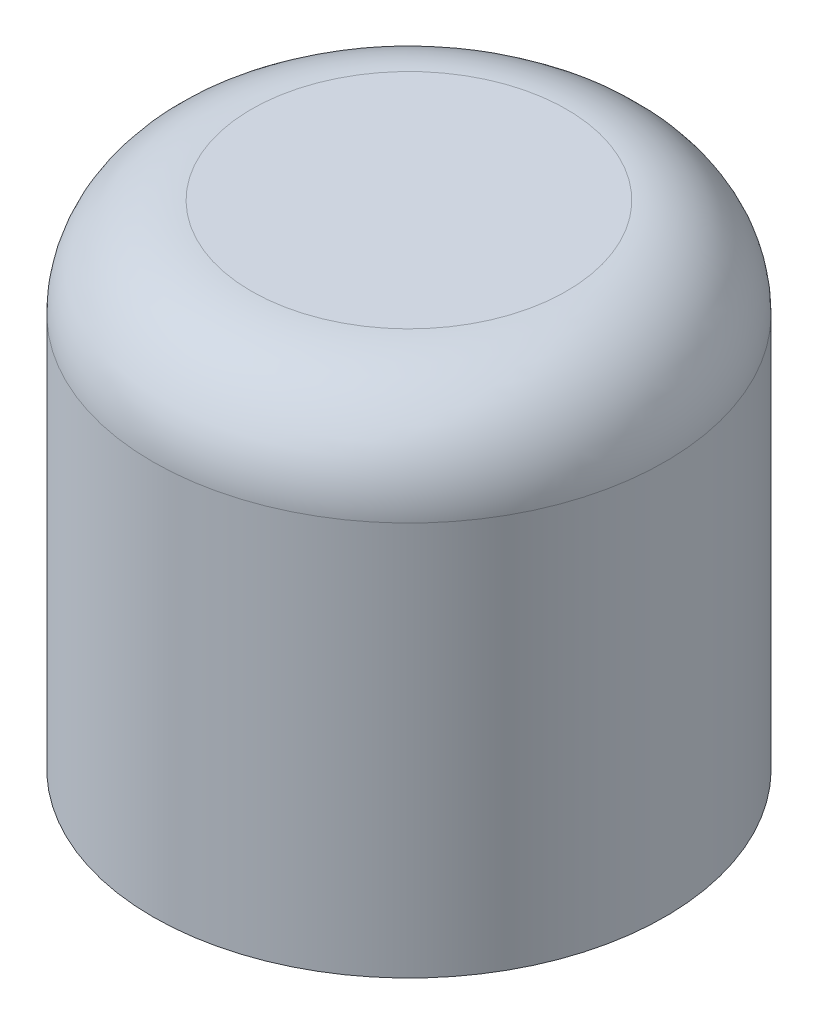
ISO-10303-21;
HEADER;
FILE_DESCRIPTION(('STEP AP214'),'2;1');
FILE_NAME('part.step','',(''),(''),'','','');
FILE_SCHEMA(('AUTOMOTIVE_DESIGN { 1 0 10303 214 1 1 1 1 }'));
ENDSEC;
DATA;
#1=APPLICATION_CONTEXT('core data for automotive mechanical design processes');
#2=APPLICATION_PROTOCOL_DEFINITION('international standard','automotive_design',2000,#1);
#3=PRODUCT_CONTEXT('',#1,'mechanical');
#4=PRODUCT('Part','Part','',(#3));
#5=PRODUCT_RELATED_PRODUCT_CATEGORY('part','',(#4));
#6=PRODUCT_DEFINITION_FORMATION('','',#4);
#7=PRODUCT_DEFINITION_CONTEXT('part definition',#1,'design');
#8=PRODUCT_DEFINITION('design','',#6,#7);
#9=PRODUCT_DEFINITION_SHAPE('','',#8);
#10=(LENGTH_UNIT() NAMED_UNIT(*) SI_UNIT(.MILLI.,.METRE.));
#11=(NAMED_UNIT(*) PLANE_ANGLE_UNIT() SI_UNIT($,.RADIAN.));
#12=(NAMED_UNIT(*) SI_UNIT($,.STERADIAN.) SOLID_ANGLE_UNIT());
#13=UNCERTAINTY_MEASURE_WITH_UNIT(LENGTH_MEASURE(1.E-05),#10,'distance_accuracy_value','');
#14=(GEOMETRIC_REPRESENTATION_CONTEXT(3) GLOBAL_UNCERTAINTY_ASSIGNED_CONTEXT((#13)) GLOBAL_UNIT_ASSIGNED_CONTEXT((#10,
#11,#12)) REPRESENTATION_CONTEXT('',''));
#15=CARTESIAN_POINT('',(0.,0.,0.));
#16=DIRECTION('',(0.,0.,1.));
#17=DIRECTION('',(1.,0.,0.));
#18=AXIS2_PLACEMENT_3D('',#15,#16,#17);
#19=CARTESIAN_POINT('',(0.,5.,0.));
#20=DIRECTION('',(0.,-1.,0.));
#21=DIRECTION('',(0.,0.,-1.));
#22=AXIS2_PLACEMENT_3D('',#19,#20,#21);
#23=CYLINDRICAL_SURFACE('',#22,2.6);
#24=CARTESIAN_POINT('',(0.,4.,0.));
#25=DIRECTION('',(0.,1.,0.));
#26=DIRECTION('',(0.,0.,1.));
#27=AXIS2_PLACEMENT_3D('',#24,#25,#26);
#28=CIRCLE('',#27,2.6);
#29=CARTESIAN_POINT('',(0.,4.,2.6));
#30=VERTEX_POINT('',#29);
#31=EDGE_CURVE('E10',#30,#30,#28,.F.);
#32=ORIENTED_EDGE('',*,*,#31,.T.);
#33=EDGE_LOOP('',(#32));
#34=FACE_BOUND('',#33,.T.);
#35=CARTESIAN_POINT('',(0.,0.,0.));
#36=DIRECTION('',(0.,1.,0.));
#37=DIRECTION('',(0.,0.,1.));
#38=AXIS2_PLACEMENT_3D('',#35,#36,#37);
#39=CIRCLE('',#38,2.6);
#40=CARTESIAN_POINT('',(0.,0.,2.6));
#41=VERTEX_POINT('',#40);
#42=EDGE_CURVE('E42',#41,#41,#39,.T.);
#43=ORIENTED_EDGE('',*,*,#42,.T.);
#44=EDGE_LOOP('',(#43));
#45=FACE_BOUND('',#44,.T.);
#46=ADVANCED_FACE('F31',(#34,#45),#23,.T.);
#47=CARTESIAN_POINT('',(0.,5.,0.));
#48=DIRECTION('',(0.,1.,0.));
#49=DIRECTION('',(0.,0.,1.));
#50=AXIS2_PLACEMENT_3D('',#47,#48,#49);
#51=PLANE('',#50);
#52=CARTESIAN_POINT('',(0.,5.,0.));
#53=DIRECTION('',(0.,1.,0.));
#54=DIRECTION('',(0.,0.,1.));
#55=AXIS2_PLACEMENT_3D('',#52,#53,#54);
#56=CIRCLE('',#55,1.6);
#57=CARTESIAN_POINT('',(0.,5.,1.6));
#58=VERTEX_POINT('',#57);
#59=EDGE_CURVE('E38',#58,#58,#56,.T.);
#60=ORIENTED_EDGE('',*,*,#59,.T.);
#61=EDGE_LOOP('',(#60));
#62=FACE_BOUND('',#61,.T.);
#63=ADVANCED_FACE('F52',(#62),#51,.T.);
#64=CARTESIAN_POINT('',(0.,0.,0.));
#65=DIRECTION('',(0.,1.,0.));
#66=DIRECTION('',(0.,0.,1.));
#67=AXIS2_PLACEMENT_3D('',#64,#65,#66);
#68=PLANE('',#67);
#69=ORIENTED_EDGE('',*,*,#42,.F.);
#70=EDGE_LOOP('',(#69));
#71=FACE_BOUND('',#70,.T.);
#72=ADVANCED_FACE('F50',(#71),#68,.F.);
#73=CARTESIAN_POINT('',(0.,4.,0.));
#74=DIRECTION('',(0.,1.,0.));
#75=DIRECTION('',(0.,0.,1.));
#76=AXIS2_PLACEMENT_3D('',#73,#74,#75);
#77=TOROIDAL_SURFACE('',#76,1.6,1.);
#78=ORIENTED_EDGE('',*,*,#31,.F.);
#79=EDGE_LOOP('',(#78));
#80=FACE_BOUND('',#79,.T.);
#81=ORIENTED_EDGE('',*,*,#59,.F.);
#82=EDGE_LOOP('',(#81));
#83=FACE_BOUND('',#82,.T.);
#84=ADVANCED_FACE('F33',(#80,#83),#77,.T.);
#85=CLOSED_SHELL('',(#46,#63,#72,#84));
#86=MANIFOLD_SOLID_BREP('B2',#85);
#87=ADVANCED_BREP_SHAPE_REPRESENTATION('',(#18,#86),#14);
#88=SHAPE_DEFINITION_REPRESENTATION(#9,#87);
ENDSEC;
END-ISO-10303-21;
